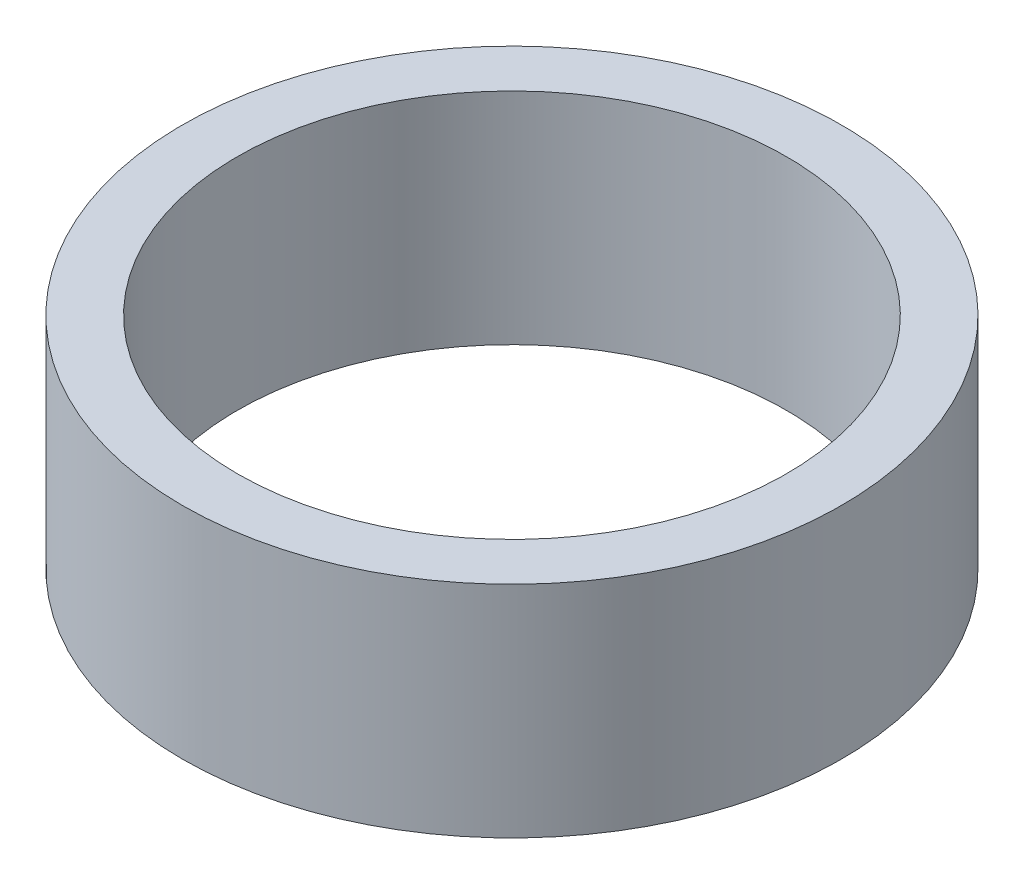
ISO-10303-21;
HEADER;
FILE_DESCRIPTION(('STEP AP214'),'2;1');
FILE_NAME('part.step','',(''),(''),'','','');
FILE_SCHEMA(('AUTOMOTIVE_DESIGN { 1 0 10303 214 1 1 1 1 }'));
ENDSEC;
DATA;
#1=APPLICATION_CONTEXT('core data for automotive mechanical design processes');
#2=APPLICATION_PROTOCOL_DEFINITION('international standard','automotive_design',2000,#1);
#3=PRODUCT_CONTEXT('',#1,'mechanical');
#4=PRODUCT('Part','Part','',(#3));
#5=PRODUCT_RELATED_PRODUCT_CATEGORY('part','',(#4));
#6=PRODUCT_DEFINITION_FORMATION('','',#4);
#7=PRODUCT_DEFINITION_CONTEXT('part definition',#1,'design');
#8=PRODUCT_DEFINITION('design','',#6,#7);
#9=PRODUCT_DEFINITION_SHAPE('','',#8);
#10=(LENGTH_UNIT() NAMED_UNIT(*) SI_UNIT(.MILLI.,.METRE.));
#11=(NAMED_UNIT(*) PLANE_ANGLE_UNIT() SI_UNIT($,.RADIAN.));
#12=(NAMED_UNIT(*) SI_UNIT($,.STERADIAN.) SOLID_ANGLE_UNIT());
#13=UNCERTAINTY_MEASURE_WITH_UNIT(LENGTH_MEASURE(1.E-05),#10,'distance_accuracy_value','');
#14=(GEOMETRIC_REPRESENTATION_CONTEXT(3) GLOBAL_UNCERTAINTY_ASSIGNED_CONTEXT((#13)) GLOBAL_UNIT_ASSIGNED_CONTEXT((#10,
#11,#12)) REPRESENTATION_CONTEXT('',''));
#15=CARTESIAN_POINT('',(0.,0.,0.));
#16=DIRECTION('',(0.,0.,1.));
#17=DIRECTION('',(1.,0.,0.));
#18=AXIS2_PLACEMENT_3D('',#15,#16,#17);
#19=CARTESIAN_POINT('',(0.,30.,0.));
#20=DIRECTION('',(0.,-1.,0.));
#21=DIRECTION('',(0.,0.,-1.));
#22=AXIS2_PLACEMENT_3D('',#19,#20,#21);
#23=CYLINDRICAL_SURFACE('',#22,45.);
#24=CARTESIAN_POINT('',(0.,30.,0.));
#25=DIRECTION('',(0.,1.,0.));
#26=DIRECTION('',(0.,0.,1.));
#27=AXIS2_PLACEMENT_3D('',#24,#25,#26);
#28=CIRCLE('',#27,45.);
#29=CARTESIAN_POINT('',(0.,30.,45.));
#30=VERTEX_POINT('',#29);
#31=EDGE_CURVE('E10',#30,#30,#28,.T.);
#32=ORIENTED_EDGE('',*,*,#31,.F.);
#33=EDGE_LOOP('',(#32));
#34=FACE_BOUND('',#33,.T.);
#35=CARTESIAN_POINT('',(0.,0.,0.));
#36=DIRECTION('',(0.,1.,0.));
#37=DIRECTION('',(0.,0.,1.));
#38=AXIS2_PLACEMENT_3D('',#35,#36,#37);
#39=CIRCLE('',#38,45.);
#40=CARTESIAN_POINT('',(0.,0.,45.));
#41=VERTEX_POINT('',#40);
#42=EDGE_CURVE('E37',#41,#41,#39,.T.);
#43=ORIENTED_EDGE('',*,*,#42,.T.);
#44=EDGE_LOOP('',(#43));
#45=FACE_BOUND('',#44,.T.);
#46=ADVANCED_FACE('F40',(#34,#45),#23,.T.);
#47=CARTESIAN_POINT('',(0.,30.,0.));
#48=DIRECTION('',(0.,1.,0.));
#49=DIRECTION('',(0.,0.,1.));
#50=AXIS2_PLACEMENT_3D('',#47,#48,#49);
#51=PLANE('',#50);
#52=CARTESIAN_POINT('',(0.,30.,0.));
#53=DIRECTION('',(0.,1.,0.));
#54=DIRECTION('',(0.,0.,1.));
#55=AXIS2_PLACEMENT_3D('',#52,#53,#54);
#56=CIRCLE('',#55,37.5);
#57=CARTESIAN_POINT('',(0.,30.,37.5));
#58=VERTEX_POINT('',#57);
#59=EDGE_CURVE('E50',#58,#58,#56,.T.);
#60=ORIENTED_EDGE('',*,*,#59,.F.);
#61=EDGE_LOOP('',(#60));
#62=FACE_BOUND('',#61,.T.);
#63=ORIENTED_EDGE('',*,*,#31,.T.);
#64=EDGE_LOOP('',(#63));
#65=FACE_BOUND('',#64,.T.);
#66=ADVANCED_FACE('F59',(#62,#65),#51,.T.);
#67=CARTESIAN_POINT('',(0.,0.,0.));
#68=DIRECTION('',(0.,1.,0.));
#69=DIRECTION('',(0.,0.,1.));
#70=AXIS2_PLACEMENT_3D('',#67,#68,#69);
#71=PLANE('',#70);
#72=CARTESIAN_POINT('',(0.,0.,0.));
#73=DIRECTION('',(0.,1.,0.));
#74=DIRECTION('',(0.,0.,1.));
#75=AXIS2_PLACEMENT_3D('',#72,#73,#74);
#76=CIRCLE('',#75,37.5);
#77=CARTESIAN_POINT('',(0.,0.,37.5));
#78=VERTEX_POINT('',#77);
#79=EDGE_CURVE('E47',#78,#78,#76,.T.);
#80=ORIENTED_EDGE('',*,*,#79,.T.);
#81=EDGE_LOOP('',(#80));
#82=FACE_BOUND('',#81,.T.);
#83=ORIENTED_EDGE('',*,*,#42,.F.);
#84=EDGE_LOOP('',(#83));
#85=FACE_BOUND('',#84,.T.);
#86=ADVANCED_FACE('F58',(#82,#85),#71,.F.);
#87=CARTESIAN_POINT('',(0.,30.,0.));
#88=DIRECTION('',(0.,-1.,0.));
#89=DIRECTION('',(0.,0.,-1.));
#90=AXIS2_PLACEMENT_3D('',#87,#88,#89);
#91=CYLINDRICAL_SURFACE('',#90,37.5);
#92=ORIENTED_EDGE('',*,*,#59,.T.);
#93=EDGE_LOOP('',(#92));
#94=FACE_BOUND('',#93,.T.);
#95=ORIENTED_EDGE('',*,*,#79,.F.);
#96=EDGE_LOOP('',(#95));
#97=FACE_BOUND('',#96,.T.);
#98=ADVANCED_FACE('F54',(#94,#97),#91,.F.);
#99=CLOSED_SHELL('',(#46,#66,#86,#98));
#100=MANIFOLD_SOLID_BREP('B2',#99);
#101=ADVANCED_BREP_SHAPE_REPRESENTATION('',(#18,#100),#14);
#102=SHAPE_DEFINITION_REPRESENTATION(#9,#101);
ENDSEC;
END-ISO-10303-21;
